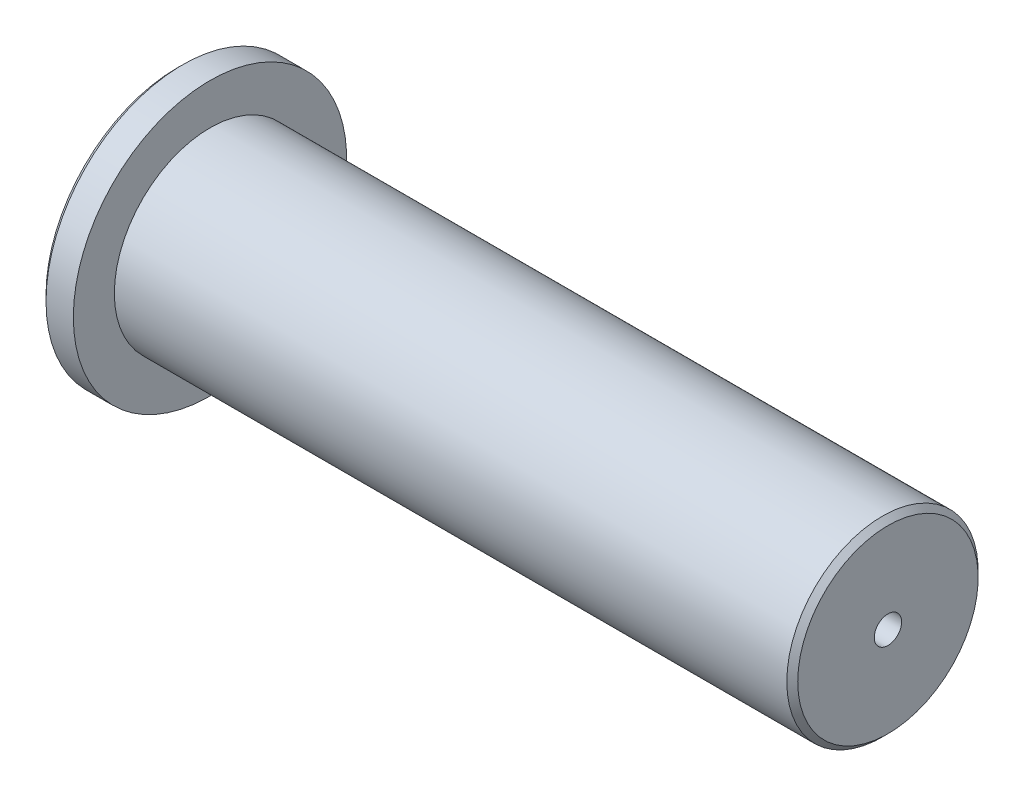
ISO-10303-21;
HEADER;
FILE_DESCRIPTION(('STEP AP214'),'2;1');
FILE_NAME('part.step','',(''),(''),'','','');
FILE_SCHEMA(('AUTOMOTIVE_DESIGN { 1 0 10303 214 1 1 1 1 }'));
ENDSEC;
DATA;
#1=APPLICATION_CONTEXT('core data for automotive mechanical design processes');
#2=APPLICATION_PROTOCOL_DEFINITION('international standard','automotive_design',2000,#1);
#3=PRODUCT_CONTEXT('',#1,'mechanical');
#4=PRODUCT('Part','Part','',(#3));
#5=PRODUCT_RELATED_PRODUCT_CATEGORY('part','',(#4));
#6=PRODUCT_DEFINITION_FORMATION('','',#4);
#7=PRODUCT_DEFINITION_CONTEXT('part definition',#1,'design');
#8=PRODUCT_DEFINITION('design','',#6,#7);
#9=PRODUCT_DEFINITION_SHAPE('','',#8);
#10=(LENGTH_UNIT() NAMED_UNIT(*) SI_UNIT(.MILLI.,.METRE.));
#11=(NAMED_UNIT(*) PLANE_ANGLE_UNIT() SI_UNIT($,.RADIAN.));
#12=(NAMED_UNIT(*) SI_UNIT($,.STERADIAN.) SOLID_ANGLE_UNIT());
#13=UNCERTAINTY_MEASURE_WITH_UNIT(LENGTH_MEASURE(1.E-05),#10,'distance_accuracy_value','');
#14=(GEOMETRIC_REPRESENTATION_CONTEXT(3) GLOBAL_UNCERTAINTY_ASSIGNED_CONTEXT((#13)) GLOBAL_UNIT_ASSIGNED_CONTEXT((#10,
#11,#12)) REPRESENTATION_CONTEXT('',''));
#15=CARTESIAN_POINT('',(0.,0.,0.));
#16=DIRECTION('',(0.,0.,1.));
#17=DIRECTION('',(1.,0.,0.));
#18=AXIS2_PLACEMENT_3D('',#15,#16,#17);
#19=CARTESIAN_POINT('',(-4106.17838032797,-7397.48323822232,0.));
#20=DIRECTION('',(-1.,0.,0.));
#21=DIRECTION('',(0.,0.,1.));
#22=AXIS2_PLACEMENT_3D('',#19,#20,#21);
#23=PLANE('',#22);
#24=CARTESIAN_POINT('',(-4106.17838032797,-7413.98323822232,0.));
#25=DIRECTION('',(-1.,0.,0.));
#26=DIRECTION('',(0.,0.,1.));
#27=AXIS2_PLACEMENT_3D('',#24,#25,#26);
#28=CIRCLE('',#27,16.4999999999997);
#29=CARTESIAN_POINT('',(-4106.17838032797,-7413.98323822232,16.4999999999997));
#30=VERTEX_POINT('',#29);
#31=EDGE_CURVE('E65',#30,#30,#28,.T.);
#32=ORIENTED_EDGE('',*,*,#31,.F.);
#33=EDGE_LOOP('',(#32));
#34=FACE_BOUND('',#33,.T.);
#35=CARTESIAN_POINT('',(-4106.17838032797,-7413.98323822232,0.));
#36=DIRECTION('',(1.,0.,0.));
#37=DIRECTION('',(0.,0.,-1.));
#38=AXIS2_PLACEMENT_3D('',#35,#36,#37);
#39=CIRCLE('',#38,2.50000000000039);
#40=CARTESIAN_POINT('',(-4106.17838032797,-7413.98323822232,-2.50000000000039));
#41=VERTEX_POINT('',#40);
#42=EDGE_CURVE('E55',#41,#41,#39,.T.);
#43=ORIENTED_EDGE('',*,*,#42,.F.);
#44=EDGE_LOOP('',(#43));
#45=FACE_BOUND('',#44,.T.);
#46=ADVANCED_FACE('F34',(#34,#45),#23,.F.);
#47=CARTESIAN_POINT('',(-4230.17838032797,-7396.48323822232,0.));
#48=DIRECTION('',(-1.,0.,0.));
#49=DIRECTION('',(0.,0.,1.));
#50=AXIS2_PLACEMENT_3D('',#47,#48,#49);
#51=PLANE('',#50);
#52=CARTESIAN_POINT('',(-4230.17838032797,-7413.98323822232,0.));
#53=DIRECTION('',(-1.,0.,0.));
#54=DIRECTION('',(0.,0.,1.));
#55=AXIS2_PLACEMENT_3D('',#52,#53,#54);
#56=CIRCLE('',#55,25.0000000000004);
#57=CARTESIAN_POINT('',(-4230.17838032797,-7413.98323822232,25.0000000000004));
#58=VERTEX_POINT('',#57);
#59=EDGE_CURVE('E11',#58,#58,#56,.T.);
#60=ORIENTED_EDGE('',*,*,#59,.F.);
#61=EDGE_LOOP('',(#60));
#62=FACE_BOUND('',#61,.T.);
#63=CARTESIAN_POINT('',(-4230.17838032797,-7413.98323822232,0.));
#64=DIRECTION('',(-1.,0.,0.));
#65=DIRECTION('',(0.,0.,1.));
#66=AXIS2_PLACEMENT_3D('',#63,#64,#65);
#67=CIRCLE('',#66,17.5000000000001);
#68=CARTESIAN_POINT('',(-4230.17838032797,-7413.98323822232,17.5000000000001));
#69=VERTEX_POINT('',#68);
#70=EDGE_CURVE('E54',#69,#69,#67,.T.);
#71=ORIENTED_EDGE('',*,*,#70,.T.);
#72=EDGE_LOOP('',(#71));
#73=FACE_BOUND('',#72,.T.);
#74=ADVANCED_FACE('F36',(#62,#73),#51,.F.);
#75=CARTESIAN_POINT('',(-4215.7186258757,-7413.98323822232,0.));
#76=DIRECTION('',(-1.,0.,0.));
#77=DIRECTION('',(0.,0.,1.));
#78=AXIS2_PLACEMENT_3D('',#75,#76,#77);
#79=CYLINDRICAL_SURFACE('',#78,25.0000000000004);
#80=CARTESIAN_POINT('',(-4235.17838032797,-7413.98323822232,0.));
#81=DIRECTION('',(-1.,0.,0.));
#82=DIRECTION('',(0.,0.,1.));
#83=AXIS2_PLACEMENT_3D('',#80,#81,#82);
#84=CIRCLE('',#83,25.0000000000004);
#85=CARTESIAN_POINT('',(-4235.17838032797,-7413.98323822232,25.0000000000004));
#86=VERTEX_POINT('',#85);
#87=EDGE_CURVE('E41',#86,#86,#84,.T.);
#88=ORIENTED_EDGE('',*,*,#87,.F.);
#89=EDGE_LOOP('',(#88));
#90=FACE_BOUND('',#89,.T.);
#91=ORIENTED_EDGE('',*,*,#59,.T.);
#92=EDGE_LOOP('',(#91));
#93=FACE_BOUND('',#92,.T.);
#94=ADVANCED_FACE('F75',(#90,#93),#79,.T.);
#95=CARTESIAN_POINT('',(-4235.17838032797,-7413.98323822232,0.));
#96=DIRECTION('',(1.,0.,0.));
#97=DIRECTION('',(0.,0.,-1.));
#98=AXIS2_PLACEMENT_3D('',#95,#96,#97);
#99=CONICAL_SURFACE('',#98,25.0000000000004,0.785398163397448);
#100=CARTESIAN_POINT('',(-4236.17838032797,-7413.98323822232,0.));
#101=DIRECTION('',(-1.,0.,0.));
#102=DIRECTION('',(0.,0.,1.));
#103=AXIS2_PLACEMENT_3D('',#100,#101,#102);
#104=CIRCLE('',#103,24.);
#105=CARTESIAN_POINT('',(-4236.17838032797,-7413.98323822232,24.));
#106=VERTEX_POINT('',#105);
#107=EDGE_CURVE('E68',#106,#106,#104,.T.);
#108=ORIENTED_EDGE('',*,*,#107,.F.);
#109=EDGE_LOOP('',(#108));
#110=FACE_BOUND('',#109,.T.);
#111=ORIENTED_EDGE('',*,*,#87,.T.);
#112=EDGE_LOOP('',(#111));
#113=FACE_BOUND('',#112,.T.);
#114=ADVANCED_FACE('F73',(#110,#113),#99,.T.);
#115=CARTESIAN_POINT('',(-4236.17838032797,-7413.98323822232,0.));
#116=DIRECTION('',(1.,0.,0.));
#117=DIRECTION('',(0.,0.,-1.));
#118=AXIS2_PLACEMENT_3D('',#115,#116,#117);
#119=PLANE('',#118);
#120=ORIENTED_EDGE('',*,*,#107,.T.);
#121=EDGE_LOOP('',(#120));
#122=FACE_BOUND('',#121,.T.);
#123=ADVANCED_FACE('F92',(#122),#119,.F.);
#124=CARTESIAN_POINT('',(-4106.17838032797,-7413.98323822232,0.));
#125=DIRECTION('',(-1.,0.,0.));
#126=DIRECTION('',(0.,0.,1.));
#127=AXIS2_PLACEMENT_3D('',#124,#125,#126);
#128=CONICAL_SURFACE('',#127,16.4999999999997,0.785398163397448);
#129=CARTESIAN_POINT('',(-4107.17838032797,-7413.98323822232,0.));
#130=DIRECTION('',(-1.,0.,0.));
#131=DIRECTION('',(0.,0.,1.));
#132=AXIS2_PLACEMENT_3D('',#129,#130,#131);
#133=CIRCLE('',#132,17.5000000000001);
#134=CARTESIAN_POINT('',(-4107.17838032797,-7413.98323822232,17.5000000000001));
#135=VERTEX_POINT('',#134);
#136=EDGE_CURVE('E58',#135,#135,#133,.T.);
#137=ORIENTED_EDGE('',*,*,#136,.F.);
#138=EDGE_LOOP('',(#137));
#139=FACE_BOUND('',#138,.T.);
#140=ORIENTED_EDGE('',*,*,#31,.T.);
#141=EDGE_LOOP('',(#140));
#142=FACE_BOUND('',#141,.T.);
#143=ADVANCED_FACE('F86',(#139,#142),#128,.T.);
#144=CARTESIAN_POINT('',(-4215.7186258757,-7413.98323822232,0.));
#145=DIRECTION('',(-1.,0.,0.));
#146=DIRECTION('',(0.,0.,1.));
#147=AXIS2_PLACEMENT_3D('',#144,#145,#146);
#148=CYLINDRICAL_SURFACE('',#147,17.5000000000001);
#149=ORIENTED_EDGE('',*,*,#70,.F.);
#150=EDGE_LOOP('',(#149));
#151=FACE_BOUND('',#150,.T.);
#152=ORIENTED_EDGE('',*,*,#136,.T.);
#153=EDGE_LOOP('',(#152));
#154=FACE_BOUND('',#153,.T.);
#155=ADVANCED_FACE('F48',(#151,#154),#148,.T.);
#156=CARTESIAN_POINT('',(-4121.17838032797,-7413.98323822232,0.));
#157=DIRECTION('',(1.,0.,0.));
#158=DIRECTION('',(0.,0.,-1.));
#159=AXIS2_PLACEMENT_3D('',#156,#157,#158);
#160=CONICAL_SURFACE('',#159,2.50000000000039,1.02974425867655);
#161=CARTESIAN_POINT('',(-4122.68053187554,-7413.98323822232,0.));
#162=VERTEX_POINT('',#161);
#163=VERTEX_LOOP('',#162);
#164=FACE_BOUND('',#163,.T.);
#165=CARTESIAN_POINT('',(-4121.17838032797,-7413.98323822232,0.));
#166=DIRECTION('',(1.,0.,0.));
#167=DIRECTION('',(0.,0.,-1.));
#168=AXIS2_PLACEMENT_3D('',#165,#166,#167);
#169=CIRCLE('',#168,2.50000000000039);
#170=CARTESIAN_POINT('',(-4121.17838032797,-7413.98323822232,-2.50000000000039));
#171=VERTEX_POINT('',#170);
#172=EDGE_CURVE('E52',#171,#171,#169,.T.);
#173=ORIENTED_EDGE('',*,*,#172,.T.);
#174=EDGE_LOOP('',(#173));
#175=FACE_BOUND('',#174,.T.);
#176=ADVANCED_FACE('F44',(#164,#175),#160,.F.);
#177=CARTESIAN_POINT('',(-4106.17838032797,-7413.98323822232,0.));
#178=DIRECTION('',(1.,0.,0.));
#179=DIRECTION('',(0.,0.,-1.));
#180=AXIS2_PLACEMENT_3D('',#177,#178,#179);
#181=CYLINDRICAL_SURFACE('',#180,2.50000000000039);
#182=ORIENTED_EDGE('',*,*,#172,.F.);
#183=EDGE_LOOP('',(#182));
#184=FACE_BOUND('',#183,.T.);
#185=ORIENTED_EDGE('',*,*,#42,.T.);
#186=EDGE_LOOP('',(#185));
#187=FACE_BOUND('',#186,.T.);
#188=ADVANCED_FACE('F47',(#184,#187),#181,.F.);
#189=CLOSED_SHELL('',(#46,#74,#94,#114,#123,#143,#155,#176,#188));
#190=MANIFOLD_SOLID_BREP('B2',#189);
#191=ADVANCED_BREP_SHAPE_REPRESENTATION('',(#18,#190),#14);
#192=SHAPE_DEFINITION_REPRESENTATION(#9,#191);
ENDSEC;
END-ISO-10303-21;
